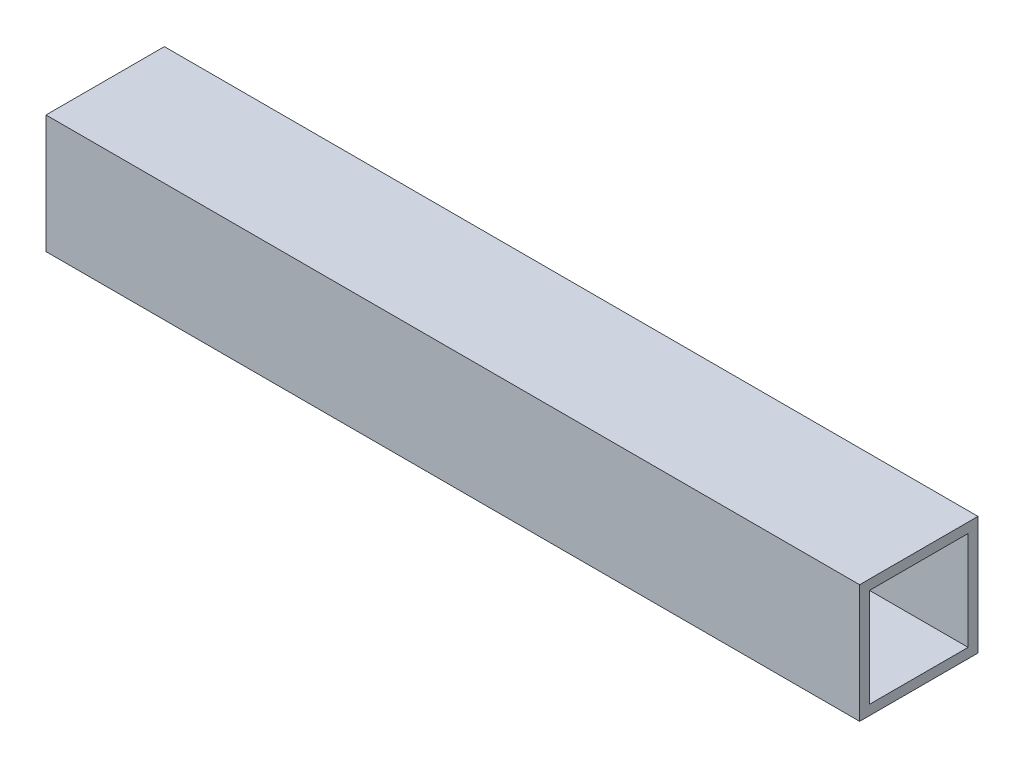
ISO-10303-21;
HEADER;
FILE_DESCRIPTION(('STEP AP214'),'2;1');
FILE_NAME('part.step','',(''),(''),'','','');
FILE_SCHEMA(('AUTOMOTIVE_DESIGN { 1 0 10303 214 1 1 1 1 }'));
ENDSEC;
DATA;
#1=APPLICATION_CONTEXT('core data for automotive mechanical design processes');
#2=APPLICATION_PROTOCOL_DEFINITION('international standard','automotive_design',2000,#1);
#3=PRODUCT_CONTEXT('',#1,'mechanical');
#4=PRODUCT('Part','Part','',(#3));
#5=PRODUCT_RELATED_PRODUCT_CATEGORY('part','',(#4));
#6=PRODUCT_DEFINITION_FORMATION('','',#4);
#7=PRODUCT_DEFINITION_CONTEXT('part definition',#1,'design');
#8=PRODUCT_DEFINITION('design','',#6,#7);
#9=PRODUCT_DEFINITION_SHAPE('','',#8);
#10=(LENGTH_UNIT() NAMED_UNIT(*) SI_UNIT(.MILLI.,.METRE.));
#11=(NAMED_UNIT(*) PLANE_ANGLE_UNIT() SI_UNIT($,.RADIAN.));
#12=(NAMED_UNIT(*) SI_UNIT($,.STERADIAN.) SOLID_ANGLE_UNIT());
#13=UNCERTAINTY_MEASURE_WITH_UNIT(LENGTH_MEASURE(1.E-05),#10,'distance_accuracy_value','');
#14=(GEOMETRIC_REPRESENTATION_CONTEXT(3) GLOBAL_UNCERTAINTY_ASSIGNED_CONTEXT((#13)) GLOBAL_UNIT_ASSIGNED_CONTEXT((#10,
#11,#12)) REPRESENTATION_CONTEXT('',''));
#15=CARTESIAN_POINT('',(0.,0.,0.));
#16=DIRECTION('',(0.,0.,1.));
#17=DIRECTION('',(1.,0.,0.));
#18=AXIS2_PLACEMENT_3D('',#15,#16,#17);
#19=CARTESIAN_POINT('',(0.,0.,-38.1));
#20=DIRECTION('',(-1.,0.,0.));
#21=DIRECTION('',(0.,0.,1.));
#22=AXIS2_PLACEMENT_3D('',#19,#20,#21);
#23=PLANE('',#22);
#24=DIRECTION('',(0.,-1.,0.));
#25=VECTOR('',#24,1.);
#26=CARTESIAN_POINT('',(0.,3.175,-3.175));
#27=LINE('',#26,#25);
#28=CARTESIAN_POINT('',(0.,34.925,-3.17499999999999));
#29=VERTEX_POINT('',#28);
#30=CARTESIAN_POINT('',(0.,3.175,-3.175));
#31=VERTEX_POINT('',#30);
#32=EDGE_CURVE('E102',#29,#31,#27,.T.);
#33=ORIENTED_EDGE('',*,*,#32,.T.);
#34=DIRECTION('',(0.,0.,-1.));
#35=VECTOR('',#34,1.);
#36=CARTESIAN_POINT('',(0.,3.17499999999999,-34.925));
#37=LINE('',#36,#35);
#38=CARTESIAN_POINT('',(0.,3.17499999999999,-34.925));
#39=VERTEX_POINT('',#38);
#40=EDGE_CURVE('E110',#31,#39,#37,.T.);
#41=ORIENTED_EDGE('',*,*,#40,.T.);
#42=DIRECTION('',(0.,1.,0.));
#43=VECTOR('',#42,1.);
#44=CARTESIAN_POINT('',(0.,3.17499999999999,-34.925));
#45=LINE('',#44,#43);
#46=CARTESIAN_POINT('',(0.,34.925,-34.925));
#47=VERTEX_POINT('',#46);
#48=EDGE_CURVE('E50',#39,#47,#45,.T.);
#49=ORIENTED_EDGE('',*,*,#48,.T.);
#50=DIRECTION('',(0.,0.,1.));
#51=VECTOR('',#50,1.);
#52=CARTESIAN_POINT('',(0.,34.925,-34.925));
#53=LINE('',#52,#51);
#54=EDGE_CURVE('E107',#47,#29,#53,.T.);
#55=ORIENTED_EDGE('',*,*,#54,.T.);
#56=EDGE_LOOP('',(#33,#41,#49,#55));
#57=FACE_BOUND('',#56,.T.);
#58=DIRECTION('',(0.,-1.,0.));
#59=VECTOR('',#58,1.);
#60=CARTESIAN_POINT('',(0.,0.,0.));
#61=LINE('',#60,#59);
#62=CARTESIAN_POINT('',(0.,38.1,0.));
#63=VERTEX_POINT('',#62);
#64=CARTESIAN_POINT('',(0.,0.,0.));
#65=VERTEX_POINT('',#64);
#66=EDGE_CURVE('E122',#63,#65,#61,.T.);
#67=ORIENTED_EDGE('',*,*,#66,.F.);
#68=DIRECTION('',(0.,0.,1.));
#69=VECTOR('',#68,1.);
#70=CARTESIAN_POINT('',(0.,38.1,-38.1));
#71=LINE('',#70,#69);
#72=CARTESIAN_POINT('',(0.,38.1,-38.1));
#73=VERTEX_POINT('',#72);
#74=EDGE_CURVE('E151',#73,#63,#71,.T.);
#75=ORIENTED_EDGE('',*,*,#74,.F.);
#76=DIRECTION('',(0.,-1.,0.));
#77=VECTOR('',#76,1.);
#78=CARTESIAN_POINT('',(0.,0.,-38.1));
#79=LINE('',#78,#77);
#80=CARTESIAN_POINT('',(0.,0.,-38.1));
#81=VERTEX_POINT('',#80);
#82=EDGE_CURVE('E127',#73,#81,#79,.T.);
#83=ORIENTED_EDGE('',*,*,#82,.T.);
#84=DIRECTION('',(0.,0.,1.));
#85=VECTOR('',#84,1.);
#86=CARTESIAN_POINT('',(0.,0.,-38.1));
#87=LINE('',#86,#85);
#88=EDGE_CURVE('E140',#81,#65,#87,.T.);
#89=ORIENTED_EDGE('',*,*,#88,.T.);
#90=EDGE_LOOP('',(#67,#75,#83,#89));
#91=FACE_BOUND('',#90,.T.);
#92=ADVANCED_FACE('F36',(#57,#91),#23,.T.);
#93=CARTESIAN_POINT('',(0.,38.1,-38.1));
#94=DIRECTION('',(0.,1.,0.));
#95=DIRECTION('',(0.,0.,1.));
#96=AXIS2_PLACEMENT_3D('',#93,#94,#95);
#97=PLANE('',#96);
#98=DIRECTION('',(-1.,0.,0.));
#99=VECTOR('',#98,1.);
#100=CARTESIAN_POINT('',(0.,38.1,0.));
#101=LINE('',#100,#99);
#102=CARTESIAN_POINT('',(261.9,38.1,0.));
#103=VERTEX_POINT('',#102);
#104=EDGE_CURVE('E131',#103,#63,#101,.T.);
#105=ORIENTED_EDGE('',*,*,#104,.F.);
#106=DIRECTION('',(0.,0.,1.));
#107=VECTOR('',#106,1.);
#108=CARTESIAN_POINT('',(261.9,38.1,-38.1));
#109=LINE('',#108,#107);
#110=CARTESIAN_POINT('',(261.9,38.1,-38.1));
#111=VERTEX_POINT('',#110);
#112=EDGE_CURVE('E154',#111,#103,#109,.T.);
#113=ORIENTED_EDGE('',*,*,#112,.F.);
#114=DIRECTION('',(-1.,0.,0.));
#115=VECTOR('',#114,1.);
#116=CARTESIAN_POINT('',(0.,38.1,-38.1));
#117=LINE('',#116,#115);
#118=EDGE_CURVE('E137',#111,#73,#117,.T.);
#119=ORIENTED_EDGE('',*,*,#118,.T.);
#120=ORIENTED_EDGE('',*,*,#74,.T.);
#121=EDGE_LOOP('',(#105,#113,#119,#120));
#122=FACE_BOUND('',#121,.T.);
#123=ADVANCED_FACE('F178',(#122),#97,.T.);
#124=CARTESIAN_POINT('',(261.9,0.,-38.1));
#125=DIRECTION('',(1.,0.,0.));
#126=DIRECTION('',(0.,0.,-1.));
#127=AXIS2_PLACEMENT_3D('',#124,#125,#126);
#128=PLANE('',#127);
#129=DIRECTION('',(0.,-1.,0.));
#130=VECTOR('',#129,1.);
#131=CARTESIAN_POINT('',(261.9,0.,-3.175));
#132=LINE('',#131,#130);
#133=CARTESIAN_POINT('',(261.9,34.925,-3.17499999999999));
#134=VERTEX_POINT('',#133);
#135=CARTESIAN_POINT('',(261.9,3.175,-3.175));
#136=VERTEX_POINT('',#135);
#137=EDGE_CURVE('E11',#134,#136,#132,.T.);
#138=ORIENTED_EDGE('',*,*,#137,.F.);
#139=DIRECTION('',(0.,0.,1.));
#140=VECTOR('',#139,1.);
#141=CARTESIAN_POINT('',(261.9,34.925,-38.1));
#142=LINE('',#141,#140);
#143=CARTESIAN_POINT('',(261.9,34.925,-34.925));
#144=VERTEX_POINT('',#143);
#145=EDGE_CURVE('E43',#144,#134,#142,.T.);
#146=ORIENTED_EDGE('',*,*,#145,.F.);
#147=DIRECTION('',(0.,1.,0.));
#148=VECTOR('',#147,1.);
#149=CARTESIAN_POINT('',(261.9,0.,-34.925));
#150=LINE('',#149,#148);
#151=CARTESIAN_POINT('',(261.9,3.17499999999999,-34.925));
#152=VERTEX_POINT('',#151);
#153=EDGE_CURVE('E160',#152,#144,#150,.T.);
#154=ORIENTED_EDGE('',*,*,#153,.F.);
#155=DIRECTION('',(0.,0.,-1.));
#156=VECTOR('',#155,1.);
#157=CARTESIAN_POINT('',(261.9,3.17499999999999,-38.1));
#158=LINE('',#157,#156);
#159=EDGE_CURVE('E153',#136,#152,#158,.T.);
#160=ORIENTED_EDGE('',*,*,#159,.F.);
#161=EDGE_LOOP('',(#138,#146,#154,#160));
#162=FACE_BOUND('',#161,.T.);
#163=DIRECTION('',(0.,1.,0.));
#164=VECTOR('',#163,1.);
#165=CARTESIAN_POINT('',(261.9,0.,0.));
#166=LINE('',#165,#164);
#167=CARTESIAN_POINT('',(261.9,0.,0.));
#168=VERTEX_POINT('',#167);
#169=EDGE_CURVE('E146',#168,#103,#166,.T.);
#170=ORIENTED_EDGE('',*,*,#169,.F.);
#171=DIRECTION('',(0.,0.,1.));
#172=VECTOR('',#171,1.);
#173=CARTESIAN_POINT('',(261.9,0.,-38.1));
#174=LINE('',#173,#172);
#175=CARTESIAN_POINT('',(261.9,0.,-38.1));
#176=VERTEX_POINT('',#175);
#177=EDGE_CURVE('E156',#176,#168,#174,.T.);
#178=ORIENTED_EDGE('',*,*,#177,.F.);
#179=DIRECTION('',(0.,1.,0.));
#180=VECTOR('',#179,1.);
#181=CARTESIAN_POINT('',(261.9,0.,-38.1));
#182=LINE('',#181,#180);
#183=EDGE_CURVE('E134',#176,#111,#182,.T.);
#184=ORIENTED_EDGE('',*,*,#183,.T.);
#185=ORIENTED_EDGE('',*,*,#112,.T.);
#186=EDGE_LOOP('',(#170,#178,#184,#185));
#187=FACE_BOUND('',#186,.T.);
#188=ADVANCED_FACE('F166',(#162,#187),#128,.T.);
#189=CARTESIAN_POINT('',(0.,0.,-38.1));
#190=DIRECTION('',(0.,-1.,0.));
#191=DIRECTION('',(0.,0.,-1.));
#192=AXIS2_PLACEMENT_3D('',#189,#190,#191);
#193=PLANE('',#192);
#194=DIRECTION('',(1.,0.,0.));
#195=VECTOR('',#194,1.);
#196=CARTESIAN_POINT('',(0.,0.,0.));
#197=LINE('',#196,#195);
#198=EDGE_CURVE('E143',#65,#168,#197,.T.);
#199=ORIENTED_EDGE('',*,*,#198,.F.);
#200=ORIENTED_EDGE('',*,*,#88,.F.);
#201=DIRECTION('',(1.,0.,0.));
#202=VECTOR('',#201,1.);
#203=CARTESIAN_POINT('',(0.,0.,-38.1));
#204=LINE('',#203,#202);
#205=EDGE_CURVE('E130',#81,#176,#204,.T.);
#206=ORIENTED_EDGE('',*,*,#205,.T.);
#207=ORIENTED_EDGE('',*,*,#177,.T.);
#208=EDGE_LOOP('',(#199,#200,#206,#207));
#209=FACE_BOUND('',#208,.T.);
#210=ADVANCED_FACE('F187',(#209),#193,.T.);
#211=CARTESIAN_POINT('',(0.,0.,-38.1));
#212=DIRECTION('',(0.,0.,-1.));
#213=DIRECTION('',(-1.,0.,0.));
#214=AXIS2_PLACEMENT_3D('',#211,#212,#213);
#215=PLANE('',#214);
#216=ORIENTED_EDGE('',*,*,#82,.F.);
#217=ORIENTED_EDGE('',*,*,#118,.F.);
#218=ORIENTED_EDGE('',*,*,#183,.F.);
#219=ORIENTED_EDGE('',*,*,#205,.F.);
#220=EDGE_LOOP('',(#216,#217,#218,#219));
#221=FACE_BOUND('',#220,.T.);
#222=ADVANCED_FACE('F194',(#221),#215,.T.);
#223=CARTESIAN_POINT('',(0.,0.,0.));
#224=DIRECTION('',(0.,0.,-1.));
#225=DIRECTION('',(-1.,0.,0.));
#226=AXIS2_PLACEMENT_3D('',#223,#224,#225);
#227=PLANE('',#226);
#228=ORIENTED_EDGE('',*,*,#66,.T.);
#229=ORIENTED_EDGE('',*,*,#198,.T.);
#230=ORIENTED_EDGE('',*,*,#169,.T.);
#231=ORIENTED_EDGE('',*,*,#104,.T.);
#232=EDGE_LOOP('',(#228,#229,#230,#231));
#233=FACE_BOUND('',#232,.T.);
#234=ADVANCED_FACE('F191',(#233),#227,.F.);
#235=CARTESIAN_POINT('',(0.,3.175,-3.175));
#236=DIRECTION('',(0.,0.,1.));
#237=DIRECTION('',(0.,-1.,0.));
#238=AXIS2_PLACEMENT_3D('',#235,#236,#237);
#239=PLANE('',#238);
#240=ORIENTED_EDGE('',*,*,#137,.T.);
#241=DIRECTION('',(1.,0.,0.));
#242=VECTOR('',#241,1.);
#243=CARTESIAN_POINT('',(0.,3.175,-3.175));
#244=LINE('',#243,#242);
#245=EDGE_CURVE('E58',#31,#136,#244,.T.);
#246=ORIENTED_EDGE('',*,*,#245,.F.);
#247=ORIENTED_EDGE('',*,*,#32,.F.);
#248=DIRECTION('',(1.,0.,0.));
#249=VECTOR('',#248,1.);
#250=CARTESIAN_POINT('',(0.,34.925,-3.17499999999999));
#251=LINE('',#250,#249);
#252=EDGE_CURVE('E120',#29,#134,#251,.T.);
#253=ORIENTED_EDGE('',*,*,#252,.T.);
#254=EDGE_LOOP('',(#240,#246,#247,#253));
#255=FACE_BOUND('',#254,.T.);
#256=ADVANCED_FACE('F99',(#255),#239,.F.);
#257=CARTESIAN_POINT('',(0.,34.925,-34.925));
#258=DIRECTION('',(0.,1.,0.));
#259=DIRECTION('',(0.,0.,1.));
#260=AXIS2_PLACEMENT_3D('',#257,#258,#259);
#261=PLANE('',#260);
#262=ORIENTED_EDGE('',*,*,#145,.T.);
#263=ORIENTED_EDGE('',*,*,#252,.F.);
#264=ORIENTED_EDGE('',*,*,#54,.F.);
#265=DIRECTION('',(1.,0.,0.));
#266=VECTOR('',#265,1.);
#267=CARTESIAN_POINT('',(0.,34.925,-34.925));
#268=LINE('',#267,#266);
#269=EDGE_CURVE('E123',#47,#144,#268,.T.);
#270=ORIENTED_EDGE('',*,*,#269,.T.);
#271=EDGE_LOOP('',(#262,#263,#264,#270));
#272=FACE_BOUND('',#271,.T.);
#273=ADVANCED_FACE('F163',(#272),#261,.F.);
#274=CARTESIAN_POINT('',(0.,3.17499999999999,-34.925));
#275=DIRECTION('',(0.,0.,-1.));
#276=DIRECTION('',(0.,1.,0.));
#277=AXIS2_PLACEMENT_3D('',#274,#275,#276);
#278=PLANE('',#277);
#279=ORIENTED_EDGE('',*,*,#153,.T.);
#280=ORIENTED_EDGE('',*,*,#269,.F.);
#281=ORIENTED_EDGE('',*,*,#48,.F.);
#282=DIRECTION('',(1.,0.,0.));
#283=VECTOR('',#282,1.);
#284=CARTESIAN_POINT('',(0.,3.17499999999999,-34.925));
#285=LINE('',#284,#283);
#286=EDGE_CURVE('E106',#39,#152,#285,.T.);
#287=ORIENTED_EDGE('',*,*,#286,.T.);
#288=EDGE_LOOP('',(#279,#280,#281,#287));
#289=FACE_BOUND('',#288,.T.);
#290=ADVANCED_FACE('F168',(#289),#278,.F.);
#291=CARTESIAN_POINT('',(0.,3.17499999999999,-34.925));
#292=DIRECTION('',(0.,-1.,0.));
#293=DIRECTION('',(0.,0.,-1.));
#294=AXIS2_PLACEMENT_3D('',#291,#292,#293);
#295=PLANE('',#294);
#296=ORIENTED_EDGE('',*,*,#159,.T.);
#297=ORIENTED_EDGE('',*,*,#286,.F.);
#298=ORIENTED_EDGE('',*,*,#40,.F.);
#299=ORIENTED_EDGE('',*,*,#245,.T.);
#300=EDGE_LOOP('',(#296,#297,#298,#299));
#301=FACE_BOUND('',#300,.T.);
#302=ADVANCED_FACE('F111',(#301),#295,.F.);
#303=CLOSED_SHELL('',(#92,#123,#188,#210,#222,#234,#256,#273,#290,#302));
#304=MANIFOLD_SOLID_BREP('B2',#303);
#305=ADVANCED_BREP_SHAPE_REPRESENTATION('',(#18,#304),#14);
#306=SHAPE_DEFINITION_REPRESENTATION(#9,#305);
ENDSEC;
END-ISO-10303-21;
